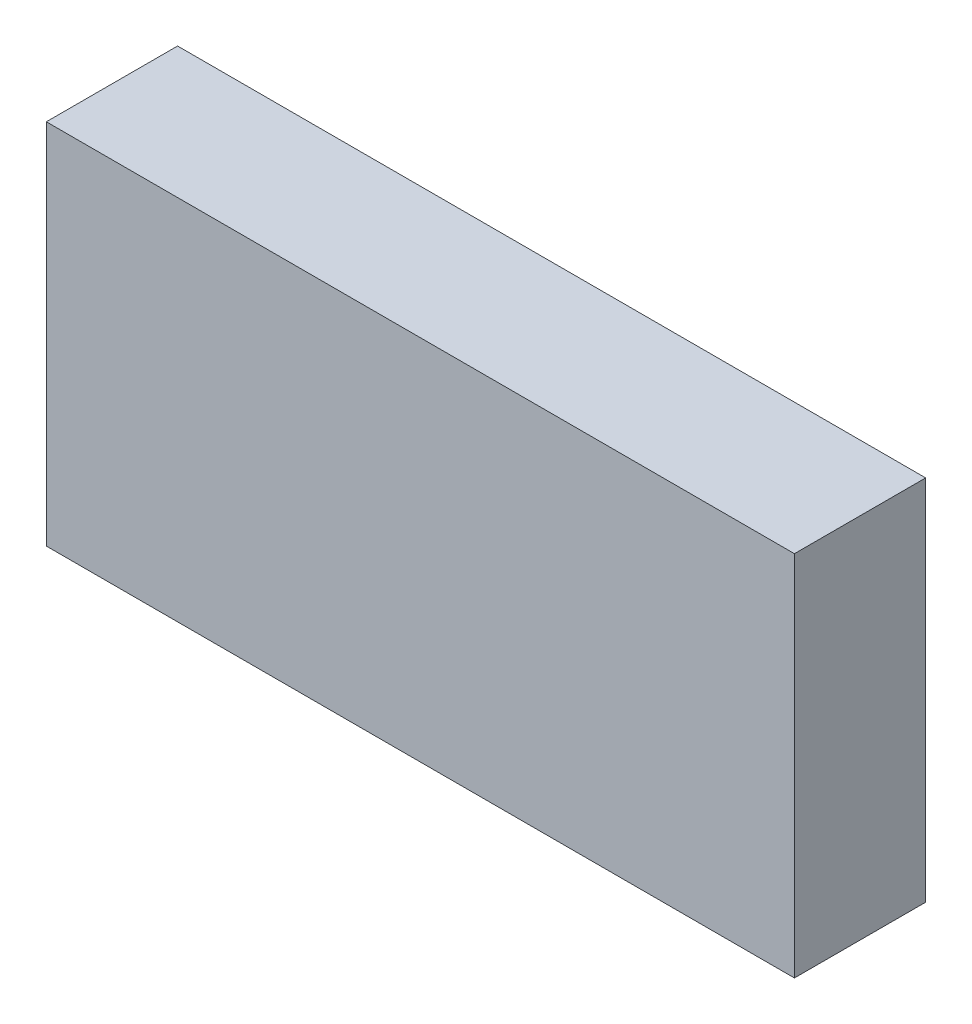
ISO-10303-21;
HEADER;
FILE_DESCRIPTION(('STEP AP214'),'2;1');
FILE_NAME('part.step','',(''),(''),'','','');
FILE_SCHEMA(('AUTOMOTIVE_DESIGN { 1 0 10303 214 1 1 1 1 }'));
ENDSEC;
DATA;
#1=APPLICATION_CONTEXT('core data for automotive mechanical design processes');
#2=APPLICATION_PROTOCOL_DEFINITION('international standard','automotive_design',2000,#1);
#3=PRODUCT_CONTEXT('',#1,'mechanical');
#4=PRODUCT('Part','Part','',(#3));
#5=PRODUCT_RELATED_PRODUCT_CATEGORY('part','',(#4));
#6=PRODUCT_DEFINITION_FORMATION('','',#4);
#7=PRODUCT_DEFINITION_CONTEXT('part definition',#1,'design');
#8=PRODUCT_DEFINITION('design','',#6,#7);
#9=PRODUCT_DEFINITION_SHAPE('','',#8);
#10=(LENGTH_UNIT() NAMED_UNIT(*) SI_UNIT(.MILLI.,.METRE.));
#11=(NAMED_UNIT(*) PLANE_ANGLE_UNIT() SI_UNIT($,.RADIAN.));
#12=(NAMED_UNIT(*) SI_UNIT($,.STERADIAN.) SOLID_ANGLE_UNIT());
#13=UNCERTAINTY_MEASURE_WITH_UNIT(LENGTH_MEASURE(1.E-05),#10,'distance_accuracy_value','');
#14=(GEOMETRIC_REPRESENTATION_CONTEXT(3) GLOBAL_UNCERTAINTY_ASSIGNED_CONTEXT((#13)) GLOBAL_UNIT_ASSIGNED_CONTEXT((#10,
#11,#12)) REPRESENTATION_CONTEXT('',''));
#15=CARTESIAN_POINT('',(0.,0.,0.));
#16=DIRECTION('',(0.,0.,1.));
#17=DIRECTION('',(1.,0.,0.));
#18=AXIS2_PLACEMENT_3D('',#15,#16,#17);
#19=CARTESIAN_POINT('',(-28.5,-14.,10.));
#20=DIRECTION('',(1.,0.,0.));
#21=DIRECTION('',(0.,0.,-1.));
#22=AXIS2_PLACEMENT_3D('',#19,#20,#21);
#23=PLANE('',#22);
#24=DIRECTION('',(0.,-1.,0.));
#25=VECTOR('',#24,1.);
#26=CARTESIAN_POINT('',(-28.5,-14.,0.));
#27=LINE('',#26,#25);
#28=CARTESIAN_POINT('',(-28.5,14.,0.));
#29=VERTEX_POINT('',#28);
#30=CARTESIAN_POINT('',(-28.5,-14.,0.));
#31=VERTEX_POINT('',#30);
#32=EDGE_CURVE('E111',#29,#31,#27,.T.);
#33=ORIENTED_EDGE('',*,*,#32,.T.);
#34=DIRECTION('',(0.,0.,-1.));
#35=VECTOR('',#34,1.);
#36=CARTESIAN_POINT('',(-28.5,-14.,10.));
#37=LINE('',#36,#35);
#38=CARTESIAN_POINT('',(-28.5,-14.,10.));
#39=VERTEX_POINT('',#38);
#40=EDGE_CURVE('E11',#39,#31,#37,.T.);
#41=ORIENTED_EDGE('',*,*,#40,.F.);
#42=DIRECTION('',(0.,-1.,0.));
#43=VECTOR('',#42,1.);
#44=CARTESIAN_POINT('',(-28.5,-14.,10.));
#45=LINE('',#44,#43);
#46=CARTESIAN_POINT('',(-28.5,14.,10.));
#47=VERTEX_POINT('',#46);
#48=EDGE_CURVE('E95',#47,#39,#45,.T.);
#49=ORIENTED_EDGE('',*,*,#48,.F.);
#50=DIRECTION('',(0.,0.,-1.));
#51=VECTOR('',#50,1.);
#52=CARTESIAN_POINT('',(-28.5,14.,10.));
#53=LINE('',#52,#51);
#54=EDGE_CURVE('E107',#47,#29,#53,.T.);
#55=ORIENTED_EDGE('',*,*,#54,.T.);
#56=EDGE_LOOP('',(#33,#41,#49,#55));
#57=FACE_BOUND('',#56,.T.);
#58=ADVANCED_FACE('F43',(#57),#23,.F.);
#59=CARTESIAN_POINT('',(28.5,-14.,10.));
#60=DIRECTION('',(0.,1.,0.));
#61=DIRECTION('',(-1.,0.,0.));
#62=AXIS2_PLACEMENT_3D('',#59,#60,#61);
#63=PLANE('',#62);
#64=DIRECTION('',(1.,0.,0.));
#65=VECTOR('',#64,1.);
#66=CARTESIAN_POINT('',(28.5,-14.,0.));
#67=LINE('',#66,#65);
#68=CARTESIAN_POINT('',(28.5,-14.,0.));
#69=VERTEX_POINT('',#68);
#70=EDGE_CURVE('E100',#31,#69,#67,.T.);
#71=ORIENTED_EDGE('',*,*,#70,.T.);
#72=DIRECTION('',(0.,0.,-1.));
#73=VECTOR('',#72,1.);
#74=CARTESIAN_POINT('',(28.5,-14.,10.));
#75=LINE('',#74,#73);
#76=CARTESIAN_POINT('',(28.5,-14.,10.));
#77=VERTEX_POINT('',#76);
#78=EDGE_CURVE('E52',#77,#69,#75,.T.);
#79=ORIENTED_EDGE('',*,*,#78,.F.);
#80=DIRECTION('',(1.,0.,0.));
#81=VECTOR('',#80,1.);
#82=CARTESIAN_POINT('',(28.5,-14.,10.));
#83=LINE('',#82,#81);
#84=EDGE_CURVE('E90',#39,#77,#83,.T.);
#85=ORIENTED_EDGE('',*,*,#84,.F.);
#86=ORIENTED_EDGE('',*,*,#40,.T.);
#87=EDGE_LOOP('',(#71,#79,#85,#86));
#88=FACE_BOUND('',#87,.T.);
#89=ADVANCED_FACE('F99',(#88),#63,.F.);
#90=CARTESIAN_POINT('',(28.5,-14.,10.));
#91=DIRECTION('',(-1.,0.,0.));
#92=DIRECTION('',(0.,0.,1.));
#93=AXIS2_PLACEMENT_3D('',#90,#91,#92);
#94=PLANE('',#93);
#95=DIRECTION('',(0.,1.,0.));
#96=VECTOR('',#95,1.);
#97=CARTESIAN_POINT('',(28.5,-14.,0.));
#98=LINE('',#97,#96);
#99=CARTESIAN_POINT('',(28.5,14.,0.));
#100=VERTEX_POINT('',#99);
#101=EDGE_CURVE('E77',#69,#100,#98,.T.);
#102=ORIENTED_EDGE('',*,*,#101,.T.);
#103=DIRECTION('',(0.,0.,-1.));
#104=VECTOR('',#103,1.);
#105=CARTESIAN_POINT('',(28.5,14.,10.));
#106=LINE('',#105,#104);
#107=CARTESIAN_POINT('',(28.5,14.,10.));
#108=VERTEX_POINT('',#107);
#109=EDGE_CURVE('E102',#108,#100,#106,.T.);
#110=ORIENTED_EDGE('',*,*,#109,.F.);
#111=DIRECTION('',(0.,1.,0.));
#112=VECTOR('',#111,1.);
#113=CARTESIAN_POINT('',(28.5,-14.,10.));
#114=LINE('',#113,#112);
#115=EDGE_CURVE('E93',#77,#108,#114,.T.);
#116=ORIENTED_EDGE('',*,*,#115,.F.);
#117=ORIENTED_EDGE('',*,*,#78,.T.);
#118=EDGE_LOOP('',(#102,#110,#116,#117));
#119=FACE_BOUND('',#118,.T.);
#120=ADVANCED_FACE('F103',(#119),#94,.F.);
#121=CARTESIAN_POINT('',(28.5,14.,10.));
#122=DIRECTION('',(0.,-1.,0.));
#123=DIRECTION('',(1.,0.,0.));
#124=AXIS2_PLACEMENT_3D('',#121,#122,#123);
#125=PLANE('',#124);
#126=DIRECTION('',(-1.,0.,0.));
#127=VECTOR('',#126,1.);
#128=CARTESIAN_POINT('',(28.5,14.,0.));
#129=LINE('',#128,#127);
#130=EDGE_CURVE('E83',#100,#29,#129,.T.);
#131=ORIENTED_EDGE('',*,*,#130,.T.);
#132=ORIENTED_EDGE('',*,*,#54,.F.);
#133=DIRECTION('',(-1.,0.,0.));
#134=VECTOR('',#133,1.);
#135=CARTESIAN_POINT('',(28.5,14.,10.));
#136=LINE('',#135,#134);
#137=EDGE_CURVE('E60',#108,#47,#136,.T.);
#138=ORIENTED_EDGE('',*,*,#137,.F.);
#139=ORIENTED_EDGE('',*,*,#109,.T.);
#140=EDGE_LOOP('',(#131,#132,#138,#139));
#141=FACE_BOUND('',#140,.T.);
#142=ADVANCED_FACE('F124',(#141),#125,.F.);
#143=CARTESIAN_POINT('',(0.,0.,10.));
#144=DIRECTION('',(0.,0.,1.));
#145=DIRECTION('',(1.,0.,0.));
#146=AXIS2_PLACEMENT_3D('',#143,#144,#145);
#147=PLANE('',#146);
#148=ORIENTED_EDGE('',*,*,#48,.T.);
#149=ORIENTED_EDGE('',*,*,#84,.T.);
#150=ORIENTED_EDGE('',*,*,#115,.T.);
#151=ORIENTED_EDGE('',*,*,#137,.T.);
#152=EDGE_LOOP('',(#148,#149,#150,#151));
#153=FACE_BOUND('',#152,.T.);
#154=ADVANCED_FACE('F91',(#153),#147,.T.);
#155=CARTESIAN_POINT('',(0.,0.,0.));
#156=DIRECTION('',(0.,0.,1.));
#157=DIRECTION('',(1.,0.,0.));
#158=AXIS2_PLACEMENT_3D('',#155,#156,#157);
#159=PLANE('',#158);
#160=ORIENTED_EDGE('',*,*,#32,.F.);
#161=ORIENTED_EDGE('',*,*,#130,.F.);
#162=ORIENTED_EDGE('',*,*,#101,.F.);
#163=ORIENTED_EDGE('',*,*,#70,.F.);
#164=EDGE_LOOP('',(#160,#161,#162,#163));
#165=FACE_BOUND('',#164,.T.);
#166=ADVANCED_FACE('F127',(#165),#159,.F.);
#167=CLOSED_SHELL('',(#58,#89,#120,#142,#154,#166));
#168=MANIFOLD_SOLID_BREP('B2',#167);
#169=ADVANCED_BREP_SHAPE_REPRESENTATION('',(#18,#168),#14);
#170=SHAPE_DEFINITION_REPRESENTATION(#9,#169);
ENDSEC;
END-ISO-10303-21;
